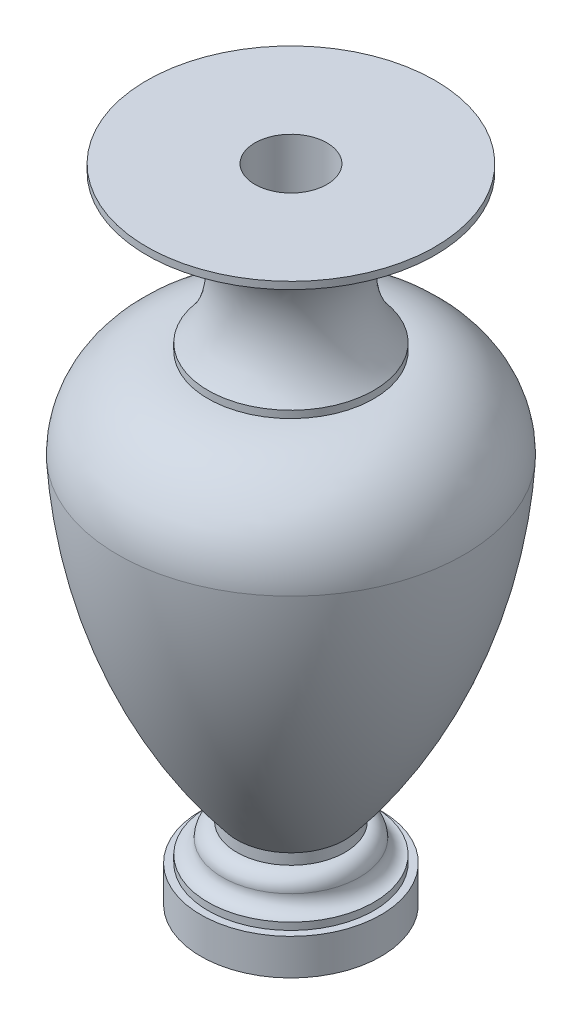
ISO-10303-21;
HEADER;
FILE_DESCRIPTION(('STEP AP214'),'2;1');
FILE_NAME('part.step','',(''),(''),'','','');
FILE_SCHEMA(('AUTOMOTIVE_DESIGN { 1 0 10303 214 1 1 1 1 }'));
ENDSEC;
DATA;
#1=APPLICATION_CONTEXT('core data for automotive mechanical design processes');
#2=APPLICATION_PROTOCOL_DEFINITION('international standard','automotive_design',2000,#1);
#3=PRODUCT_CONTEXT('',#1,'mechanical');
#4=PRODUCT('Part','Part','',(#3));
#5=PRODUCT_RELATED_PRODUCT_CATEGORY('part','',(#4));
#6=PRODUCT_DEFINITION_FORMATION('','',#4);
#7=PRODUCT_DEFINITION_CONTEXT('part definition',#1,'design');
#8=PRODUCT_DEFINITION('design','',#6,#7);
#9=PRODUCT_DEFINITION_SHAPE('','',#8);
#10=(LENGTH_UNIT() NAMED_UNIT(*) SI_UNIT(.MILLI.,.METRE.));
#11=(NAMED_UNIT(*) PLANE_ANGLE_UNIT() SI_UNIT($,.RADIAN.));
#12=(NAMED_UNIT(*) SI_UNIT($,.STERADIAN.) SOLID_ANGLE_UNIT());
#13=UNCERTAINTY_MEASURE_WITH_UNIT(LENGTH_MEASURE(1.E-05),#10,'distance_accuracy_value','');
#14=(GEOMETRIC_REPRESENTATION_CONTEXT(3) GLOBAL_UNCERTAINTY_ASSIGNED_CONTEXT((#13)) GLOBAL_UNIT_ASSIGNED_CONTEXT((#10,
#11,#12)) REPRESENTATION_CONTEXT('',''));
#15=CARTESIAN_POINT('',(0.,0.,0.));
#16=DIRECTION('',(0.,0.,1.));
#17=DIRECTION('',(1.,0.,0.));
#18=AXIS2_PLACEMENT_3D('',#15,#16,#17);
#19=CARTESIAN_POINT('',(0.,0.,0.));
#20=DIRECTION('',(0.,-1.,0.));
#21=DIRECTION('',(0.,0.,-1.));
#22=AXIS2_PLACEMENT_3D('',#19,#20,#21);
#23=PLANE('',#22);
#24=CARTESIAN_POINT('',(0.,0.,0.));
#25=DIRECTION('',(0.,-1.,0.));
#26=DIRECTION('',(0.,0.,-1.));
#27=AXIS2_PLACEMENT_3D('',#24,#25,#26);
#28=CIRCLE('',#27,25000.);
#29=CARTESIAN_POINT('',(0.,0.,-25000.));
#30=VERTEX_POINT('',#29);
#31=EDGE_CURVE('E10',#30,#30,#28,.T.);
#32=ORIENTED_EDGE('',*,*,#31,.T.);
#33=EDGE_LOOP('',(#32));
#34=FACE_BOUND('',#33,.T.);
#35=ADVANCED_FACE('F31',(#34),#23,.T.);
#36=CARTESIAN_POINT('',(0.,0.,0.));
#37=DIRECTION('',(0.,-1.,0.));
#38=DIRECTION('',(0.,0.,-1.));
#39=AXIS2_PLACEMENT_3D('',#36,#37,#38);
#40=CYLINDRICAL_SURFACE('',#39,25000.);
#41=CARTESIAN_POINT('',(0.,10000.,0.));
#42=DIRECTION('',(0.,-1.,0.));
#43=DIRECTION('',(0.,0.,-1.));
#44=AXIS2_PLACEMENT_3D('',#41,#42,#43);
#45=CIRCLE('',#44,25000.);
#46=CARTESIAN_POINT('',(0.,10000.,-25000.));
#47=VERTEX_POINT('',#46);
#48=EDGE_CURVE('E37',#47,#47,#45,.T.);
#49=ORIENTED_EDGE('',*,*,#48,.T.);
#50=EDGE_LOOP('',(#49));
#51=FACE_BOUND('',#50,.T.);
#52=ORIENTED_EDGE('',*,*,#31,.F.);
#53=EDGE_LOOP('',(#52));
#54=FACE_BOUND('',#53,.T.);
#55=ADVANCED_FACE('F102',(#51,#54),#40,.T.);
#56=CARTESIAN_POINT('',(25000.,10000.,0.));
#57=DIRECTION('',(0.,1.,0.));
#58=DIRECTION('',(0.,0.,1.));
#59=AXIS2_PLACEMENT_3D('',#56,#57,#58);
#60=PLANE('',#59);
#61=CARTESIAN_POINT('',(0.,10000.,0.));
#62=DIRECTION('',(0.,-1.,0.));
#63=DIRECTION('',(0.,0.,-1.));
#64=AXIS2_PLACEMENT_3D('',#61,#62,#63);
#65=CIRCLE('',#64,23000.);
#66=CARTESIAN_POINT('',(0.,10000.,-23000.));
#67=VERTEX_POINT('',#66);
#68=EDGE_CURVE('E41',#67,#67,#65,.T.);
#69=ORIENTED_EDGE('',*,*,#68,.T.);
#70=EDGE_LOOP('',(#69));
#71=FACE_BOUND('',#70,.T.);
#72=ORIENTED_EDGE('',*,*,#48,.F.);
#73=EDGE_LOOP('',(#72));
#74=FACE_BOUND('',#73,.T.);
#75=ADVANCED_FACE('F106',(#71,#74),#60,.T.);
#76=CARTESIAN_POINT('',(0.,0.,0.));
#77=DIRECTION('',(0.,-1.,0.));
#78=DIRECTION('',(0.,0.,-1.));
#79=AXIS2_PLACEMENT_3D('',#76,#77,#78);
#80=CYLINDRICAL_SURFACE('',#79,23000.);
#81=CARTESIAN_POINT('',(0.,12000.,0.));
#82=DIRECTION('',(0.,-1.,0.));
#83=DIRECTION('',(0.,0.,-1.));
#84=AXIS2_PLACEMENT_3D('',#81,#82,#83);
#85=CIRCLE('',#84,23000.);
#86=CARTESIAN_POINT('',(0.,12000.,-23000.));
#87=VERTEX_POINT('',#86);
#88=EDGE_CURVE('E45',#87,#87,#85,.T.);
#89=ORIENTED_EDGE('',*,*,#88,.T.);
#90=EDGE_LOOP('',(#89));
#91=FACE_BOUND('',#90,.T.);
#92=ORIENTED_EDGE('',*,*,#68,.F.);
#93=EDGE_LOOP('',(#92));
#94=FACE_BOUND('',#93,.T.);
#95=ADVANCED_FACE('F110',(#91,#94),#80,.T.);
#96=CARTESIAN_POINT('',(0.,16000.,0.));
#97=DIRECTION('',(0.,-1.,0.));
#98=DIRECTION('',(0.,0.,-1.));
#99=AXIS2_PLACEMENT_3D('',#96,#97,#98);
#100=TOROIDAL_SURFACE('',#99,23000.,4000.);
#101=CARTESIAN_POINT('',(0.,16000.,0.));
#102=DIRECTION('',(0.,-1.,0.));
#103=DIRECTION('',(0.,0.,-1.));
#104=AXIS2_PLACEMENT_3D('',#101,#102,#103);
#105=CIRCLE('',#104,19000.);
#106=CARTESIAN_POINT('',(0.,16000.,-19000.));
#107=VERTEX_POINT('',#106);
#108=EDGE_CURVE('E50',#107,#107,#105,.T.);
#109=ORIENTED_EDGE('',*,*,#108,.T.);
#110=EDGE_LOOP('',(#109));
#111=FACE_BOUND('',#110,.T.);
#112=ORIENTED_EDGE('',*,*,#88,.F.);
#113=EDGE_LOOP('',(#112));
#114=FACE_BOUND('',#113,.T.);
#115=ADVANCED_FACE('F117',(#111,#114),#100,.F.);
#116=CARTESIAN_POINT('',(0.,16000.,0.));
#117=DIRECTION('',(0.,-1.,0.));
#118=DIRECTION('',(0.,0.,-1.));
#119=AXIS2_PLACEMENT_3D('',#116,#117,#118);
#120=TOROIDAL_SURFACE('',#119,15000.,4000.);
#121=CARTESIAN_POINT('',(0.,20000.,0.));
#122=DIRECTION('',(0.,-1.,0.));
#123=DIRECTION('',(0.,0.,-1.));
#124=AXIS2_PLACEMENT_3D('',#121,#122,#123);
#125=CIRCLE('',#124,15000.);
#126=CARTESIAN_POINT('',(0.,20000.,-15000.));
#127=VERTEX_POINT('',#126);
#128=EDGE_CURVE('E53',#127,#127,#125,.T.);
#129=ORIENTED_EDGE('',*,*,#128,.T.);
#130=EDGE_LOOP('',(#129));
#131=FACE_BOUND('',#130,.T.);
#132=ORIENTED_EDGE('',*,*,#108,.F.);
#133=EDGE_LOOP('',(#132));
#134=FACE_BOUND('',#133,.T.);
#135=ADVANCED_FACE('F121',(#131,#134),#120,.T.);
#136=CARTESIAN_POINT('',(0.,0.,0.));
#137=DIRECTION('',(0.,-1.,0.));
#138=DIRECTION('',(0.,0.,-1.));
#139=AXIS2_PLACEMENT_3D('',#136,#137,#138);
#140=CYLINDRICAL_SURFACE('',#139,15000.);
#141=CARTESIAN_POINT('',(0.,23000.,0.));
#142=DIRECTION('',(0.,-1.,0.));
#143=DIRECTION('',(0.,0.,-1.));
#144=AXIS2_PLACEMENT_3D('',#141,#142,#143);
#145=CIRCLE('',#144,15000.);
#146=CARTESIAN_POINT('',(0.,23000.,-15000.));
#147=VERTEX_POINT('',#146);
#148=EDGE_CURVE('E56',#147,#147,#145,.T.);
#149=ORIENTED_EDGE('',*,*,#148,.T.);
#150=EDGE_LOOP('',(#149));
#151=FACE_BOUND('',#150,.T.);
#152=ORIENTED_EDGE('',*,*,#128,.F.);
#153=EDGE_LOOP('',(#152));
#154=FACE_BOUND('',#153,.T.);
#155=ADVANCED_FACE('F125',(#151,#154),#140,.T.);
#156=CARTESIAN_POINT('',(0.,116458.312075038,0.));
#157=DIRECTION('',(0.,-1.,0.));
#158=DIRECTION('',(0.,0.,-1.));
#159=AXIS2_PLACEMENT_3D('',#156,#157,#158);
#160=DEGENERATE_TOROIDAL_SURFACE('',#159,99758.6332442347,148000.,.F.);
#161=CARTESIAN_POINT('',(0.,107998.397520344,0.));
#162=DIRECTION('',(0.,-1.,0.));
#163=DIRECTION('',(0.,0.,-1.));
#164=AXIS2_PLACEMENT_3D('',#161,#162,#163);
#165=CIRCLE('',#164,47999.3778608396);
#166=CARTESIAN_POINT('',(0.,107998.397520344,-47999.3778608396));
#167=VERTEX_POINT('',#166);
#168=EDGE_CURVE('E59',#167,#167,#165,.T.);
#169=ORIENTED_EDGE('',*,*,#168,.T.);
#170=EDGE_LOOP('',(#169));
#171=FACE_BOUND('',#170,.T.);
#172=ORIENTED_EDGE('',*,*,#148,.F.);
#173=EDGE_LOOP('',(#172));
#174=FACE_BOUND('',#173,.T.);
#175=ADVANCED_FACE('F129',(#171,#174),#160,.F.);
#176=CARTESIAN_POINT('',(0.,107998.397520345,0.));
#177=DIRECTION('',(0.,-1.,0.));
#178=DIRECTION('',(0.,0.,-1.));
#179=AXIS2_PLACEMENT_3D('',#176,#177,#178);
#180=DEGENERATE_TOROIDAL_SURFACE('',#179,23000.,24999.3778608396,.T.);
#181=CARTESIAN_POINT('',(0.,132997.775381184,0.));
#182=DIRECTION('',(0.,-1.,0.));
#183=DIRECTION('',(0.,0.,-1.));
#184=AXIS2_PLACEMENT_3D('',#181,#182,#183);
#185=CIRCLE('',#184,23000.);
#186=CARTESIAN_POINT('',(0.,132997.775381184,-23000.));
#187=VERTEX_POINT('',#186);
#188=EDGE_CURVE('E62',#187,#187,#185,.T.);
#189=ORIENTED_EDGE('',*,*,#188,.T.);
#190=EDGE_LOOP('',(#189));
#191=FACE_BOUND('',#190,.T.);
#192=ORIENTED_EDGE('',*,*,#168,.F.);
#193=EDGE_LOOP('',(#192));
#194=FACE_BOUND('',#193,.T.);
#195=ADVANCED_FACE('F133',(#191,#194),#180,.T.);
#196=CARTESIAN_POINT('',(0.,0.,0.));
#197=DIRECTION('',(0.,-1.,0.));
#198=DIRECTION('',(0.,0.,-1.));
#199=AXIS2_PLACEMENT_3D('',#196,#197,#198);
#200=CYLINDRICAL_SURFACE('',#199,23000.);
#201=CARTESIAN_POINT('',(0.,135000.,0.));
#202=DIRECTION('',(0.,-1.,0.));
#203=DIRECTION('',(0.,0.,-1.));
#204=AXIS2_PLACEMENT_3D('',#201,#202,#203);
#205=CIRCLE('',#204,23000.);
#206=CARTESIAN_POINT('',(0.,135000.,-23000.));
#207=VERTEX_POINT('',#206);
#208=EDGE_CURVE('E65',#207,#207,#205,.T.);
#209=ORIENTED_EDGE('',*,*,#208,.T.);
#210=EDGE_LOOP('',(#209));
#211=FACE_BOUND('',#210,.T.);
#212=ORIENTED_EDGE('',*,*,#188,.F.);
#213=EDGE_LOOP('',(#212));
#214=FACE_BOUND('',#213,.T.);
#215=ADVANCED_FACE('F137',(#211,#214),#200,.T.);
#216=CARTESIAN_POINT('',(0.,151500.,0.));
#217=DIRECTION('',(0.,-1.,0.));
#218=DIRECTION('',(0.,0.,-1.));
#219=AXIS2_PLACEMENT_3D('',#216,#217,#218);
#220=TOROIDAL_SURFACE('',#219,41781.6399709929,25000.);
#221=CARTESIAN_POINT('',(0.,168000.,0.));
#222=DIRECTION('',(0.,-1.,0.));
#223=DIRECTION('',(0.,0.,-1.));
#224=AXIS2_PLACEMENT_3D('',#221,#222,#223);
#225=CIRCLE('',#224,23000.);
#226=CARTESIAN_POINT('',(0.,168000.,-23000.));
#227=VERTEX_POINT('',#226);
#228=EDGE_CURVE('E68',#227,#227,#225,.T.);
#229=ORIENTED_EDGE('',*,*,#228,.T.);
#230=EDGE_LOOP('',(#229));
#231=FACE_BOUND('',#230,.T.);
#232=ORIENTED_EDGE('',*,*,#208,.F.);
#233=EDGE_LOOP('',(#232));
#234=FACE_BOUND('',#233,.T.);
#235=ADVANCED_FACE('F141',(#231,#234),#220,.F.);
#236=CARTESIAN_POINT('',(0.,0.,0.));
#237=DIRECTION('',(0.,-1.,0.));
#238=DIRECTION('',(0.,0.,-1.));
#239=AXIS2_PLACEMENT_3D('',#236,#237,#238);
#240=CYLINDRICAL_SURFACE('',#239,23000.);
#241=CARTESIAN_POINT('',(0.,171000.,0.));
#242=DIRECTION('',(0.,-1.,0.));
#243=DIRECTION('',(0.,0.,-1.));
#244=AXIS2_PLACEMENT_3D('',#241,#242,#243);
#245=CIRCLE('',#244,23000.);
#246=CARTESIAN_POINT('',(0.,171000.,-23000.));
#247=VERTEX_POINT('',#246);
#248=EDGE_CURVE('E71',#247,#247,#245,.T.);
#249=ORIENTED_EDGE('',*,*,#248,.T.);
#250=EDGE_LOOP('',(#249));
#251=FACE_BOUND('',#250,.T.);
#252=ORIENTED_EDGE('',*,*,#228,.F.);
#253=EDGE_LOOP('',(#252));
#254=FACE_BOUND('',#253,.T.);
#255=ADVANCED_FACE('F145',(#251,#254),#240,.T.);
#256=CARTESIAN_POINT('',(0.,176000.,0.));
#257=DIRECTION('',(0.,-1.,0.));
#258=DIRECTION('',(0.,0.,-1.));
#259=AXIS2_PLACEMENT_3D('',#256,#257,#258);
#260=TOROIDAL_SURFACE('',#259,23000.,5000.);
#261=CARTESIAN_POINT('',(0.,176000.,0.));
#262=DIRECTION('',(0.,-1.,0.));
#263=DIRECTION('',(0.,0.,-1.));
#264=AXIS2_PLACEMENT_3D('',#261,#262,#263);
#265=CIRCLE('',#264,28000.);
#266=CARTESIAN_POINT('',(0.,176000.,-28000.));
#267=VERTEX_POINT('',#266);
#268=EDGE_CURVE('E74',#267,#267,#265,.T.);
#269=ORIENTED_EDGE('',*,*,#268,.T.);
#270=EDGE_LOOP('',(#269));
#271=FACE_BOUND('',#270,.T.);
#272=ORIENTED_EDGE('',*,*,#248,.F.);
#273=EDGE_LOOP('',(#272));
#274=FACE_BOUND('',#273,.T.);
#275=ADVANCED_FACE('F149',(#271,#274),#260,.T.);
#276=CARTESIAN_POINT('',(40000.,176000.,0.));
#277=DIRECTION('',(0.,-1.,0.));
#278=DIRECTION('',(0.,0.,-1.));
#279=AXIS2_PLACEMENT_3D('',#276,#277,#278);
#280=PLANE('',#279);
#281=CARTESIAN_POINT('',(0.,176000.,0.));
#282=DIRECTION('',(0.,-1.,0.));
#283=DIRECTION('',(0.,0.,-1.));
#284=AXIS2_PLACEMENT_3D('',#281,#282,#283);
#285=CIRCLE('',#284,40000.);
#286=CARTESIAN_POINT('',(0.,176000.,-40000.));
#287=VERTEX_POINT('',#286);
#288=EDGE_CURVE('E77',#287,#287,#285,.T.);
#289=ORIENTED_EDGE('',*,*,#288,.T.);
#290=EDGE_LOOP('',(#289));
#291=FACE_BOUND('',#290,.T.);
#292=ORIENTED_EDGE('',*,*,#268,.F.);
#293=EDGE_LOOP('',(#292));
#294=FACE_BOUND('',#293,.T.);
#295=ADVANCED_FACE('F153',(#291,#294),#280,.T.);
#296=CARTESIAN_POINT('',(0.,0.,0.));
#297=DIRECTION('',(0.,-1.,0.));
#298=DIRECTION('',(0.,0.,-1.));
#299=AXIS2_PLACEMENT_3D('',#296,#297,#298);
#300=CYLINDRICAL_SURFACE('',#299,40000.);
#301=CARTESIAN_POINT('',(0.,178000.,0.));
#302=DIRECTION('',(0.,-1.,0.));
#303=DIRECTION('',(0.,0.,-1.));
#304=AXIS2_PLACEMENT_3D('',#301,#302,#303);
#305=CIRCLE('',#304,40000.);
#306=CARTESIAN_POINT('',(0.,178000.,-40000.));
#307=VERTEX_POINT('',#306);
#308=EDGE_CURVE('E80',#307,#307,#305,.T.);
#309=ORIENTED_EDGE('',*,*,#308,.T.);
#310=EDGE_LOOP('',(#309));
#311=FACE_BOUND('',#310,.T.);
#312=ORIENTED_EDGE('',*,*,#288,.F.);
#313=EDGE_LOOP('',(#312));
#314=FACE_BOUND('',#313,.T.);
#315=ADVANCED_FACE('F157',(#311,#314),#300,.T.);
#316=CARTESIAN_POINT('',(10000.,178000.,0.));
#317=DIRECTION('',(0.,1.,0.));
#318=DIRECTION('',(0.,0.,1.));
#319=AXIS2_PLACEMENT_3D('',#316,#317,#318);
#320=PLANE('',#319);
#321=CARTESIAN_POINT('',(0.,178000.,0.));
#322=DIRECTION('',(0.,-1.,0.));
#323=DIRECTION('',(0.,0.,-1.));
#324=AXIS2_PLACEMENT_3D('',#321,#322,#323);
#325=CIRCLE('',#324,10000.);
#326=CARTESIAN_POINT('',(0.,178000.,-10000.));
#327=VERTEX_POINT('',#326);
#328=EDGE_CURVE('E83',#327,#327,#325,.T.);
#329=ORIENTED_EDGE('',*,*,#328,.T.);
#330=EDGE_LOOP('',(#329));
#331=FACE_BOUND('',#330,.T.);
#332=ORIENTED_EDGE('',*,*,#308,.F.);
#333=EDGE_LOOP('',(#332));
#334=FACE_BOUND('',#333,.T.);
#335=ADVANCED_FACE('F99',(#331,#334),#320,.T.);
#336=CARTESIAN_POINT('',(0.,0.,0.));
#337=DIRECTION('',(0.,-1.,0.));
#338=DIRECTION('',(0.,0.,-1.));
#339=AXIS2_PLACEMENT_3D('',#336,#337,#338);
#340=CYLINDRICAL_SURFACE('',#339,10000.);
#341=CARTESIAN_POINT('',(0.,95000.,0.));
#342=DIRECTION('',(0.,-1.,0.));
#343=DIRECTION('',(0.,0.,-1.));
#344=AXIS2_PLACEMENT_3D('',#341,#342,#343);
#345=CIRCLE('',#344,10000.);
#346=CARTESIAN_POINT('',(0.,95000.,-10000.));
#347=VERTEX_POINT('',#346);
#348=EDGE_CURVE('E86',#347,#347,#345,.T.);
#349=ORIENTED_EDGE('',*,*,#348,.T.);
#350=EDGE_LOOP('',(#349));
#351=FACE_BOUND('',#350,.T.);
#352=ORIENTED_EDGE('',*,*,#328,.F.);
#353=EDGE_LOOP('',(#352));
#354=FACE_BOUND('',#353,.T.);
#355=ADVANCED_FACE('F90',(#351,#354),#340,.F.);
#356=CARTESIAN_POINT('',(0.,95000.,0.));
#357=DIRECTION('',(0.,-1.,0.));
#358=DIRECTION('',(1.,0.,0.));
#359=AXIS2_PLACEMENT_3D('',#356,#357,#358);
#360=SPHERICAL_SURFACE('',#359,10000.);
#361=ORIENTED_EDGE('',*,*,#348,.F.);
#362=EDGE_LOOP('',(#361));
#363=FACE_BOUND('',#362,.T.);
#364=ADVANCED_FACE('F93',(#363),#360,.F.);
#365=CLOSED_SHELL('',(#35,#55,#75,#95,#115,#135,#155,#175,#195,#215,#235,#255,#275,#295,#315,
#335,#355,#364));
#366=MANIFOLD_SOLID_BREP('B2',#365);
#367=ADVANCED_BREP_SHAPE_REPRESENTATION('',(#18,#366),#14);
#368=SHAPE_DEFINITION_REPRESENTATION(#9,#367);
ENDSEC;
END-ISO-10303-21;
